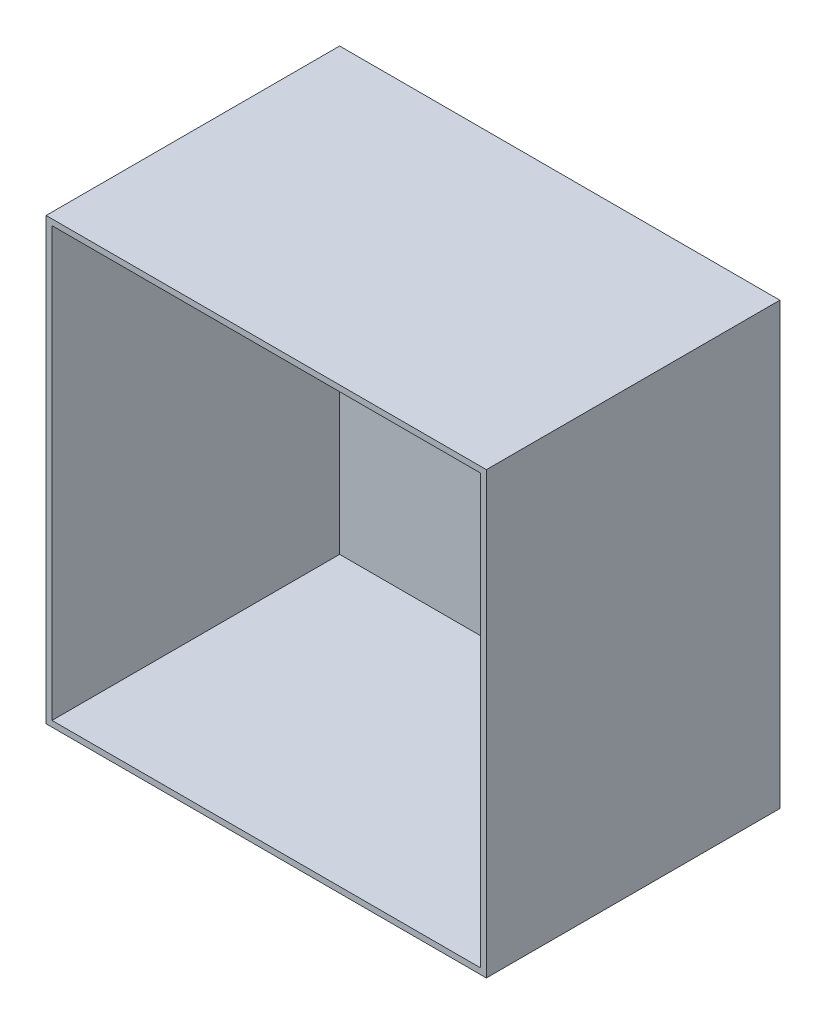
ISO-10303-21;
HEADER;
FILE_DESCRIPTION(('STEP AP214'),'2;1');
FILE_NAME('part.step','',(''),(''),'','','');
FILE_SCHEMA(('AUTOMOTIVE_DESIGN { 1 0 10303 214 1 1 1 1 }'));
ENDSEC;
DATA;
#1=APPLICATION_CONTEXT('core data for automotive mechanical design processes');
#2=APPLICATION_PROTOCOL_DEFINITION('international standard','automotive_design',2000,#1);
#3=PRODUCT_CONTEXT('',#1,'mechanical');
#4=PRODUCT('Part','Part','',(#3));
#5=PRODUCT_RELATED_PRODUCT_CATEGORY('part','',(#4));
#6=PRODUCT_DEFINITION_FORMATION('','',#4);
#7=PRODUCT_DEFINITION_CONTEXT('part definition',#1,'design');
#8=PRODUCT_DEFINITION('design','',#6,#7);
#9=PRODUCT_DEFINITION_SHAPE('','',#8);
#10=(LENGTH_UNIT() NAMED_UNIT(*) SI_UNIT(.MILLI.,.METRE.));
#11=(NAMED_UNIT(*) PLANE_ANGLE_UNIT() SI_UNIT($,.RADIAN.));
#12=(NAMED_UNIT(*) SI_UNIT($,.STERADIAN.) SOLID_ANGLE_UNIT());
#13=UNCERTAINTY_MEASURE_WITH_UNIT(LENGTH_MEASURE(1.E-05),#10,'distance_accuracy_value','');
#14=(GEOMETRIC_REPRESENTATION_CONTEXT(3) GLOBAL_UNCERTAINTY_ASSIGNED_CONTEXT((#13)) GLOBAL_UNIT_ASSIGNED_CONTEXT((#10,
#11,#12)) REPRESENTATION_CONTEXT('',''));
#15=CARTESIAN_POINT('',(0.,0.,0.));
#16=DIRECTION('',(0.,0.,1.));
#17=DIRECTION('',(1.,0.,0.));
#18=AXIS2_PLACEMENT_3D('',#15,#16,#17);
#19=CARTESIAN_POINT('',(-75.,-75.,100.));
#20=DIRECTION('',(1.,0.,0.));
#21=DIRECTION('',(0.,1.,0.));
#22=AXIS2_PLACEMENT_3D('',#19,#20,#21);
#23=PLANE('',#22);
#24=DIRECTION('',(0.,-1.,0.));
#25=VECTOR('',#24,1.);
#26=CARTESIAN_POINT('',(-75.,-75.,0.));
#27=LINE('',#26,#25);
#28=CARTESIAN_POINT('',(-75.,75.,0.));
#29=VERTEX_POINT('',#28);
#30=CARTESIAN_POINT('',(-75.,-75.,0.));
#31=VERTEX_POINT('',#30);
#32=EDGE_CURVE('E148',#29,#31,#27,.T.);
#33=ORIENTED_EDGE('',*,*,#32,.T.);
#34=DIRECTION('',(0.,0.,-1.));
#35=VECTOR('',#34,1.);
#36=CARTESIAN_POINT('',(-75.,-75.,100.));
#37=LINE('',#36,#35);
#38=CARTESIAN_POINT('',(-75.,-75.,100.));
#39=VERTEX_POINT('',#38);
#40=EDGE_CURVE('E11',#39,#31,#37,.T.);
#41=ORIENTED_EDGE('',*,*,#40,.F.);
#42=DIRECTION('',(0.,-1.,0.));
#43=VECTOR('',#42,1.);
#44=CARTESIAN_POINT('',(-75.,-75.,100.));
#45=LINE('',#44,#43);
#46=CARTESIAN_POINT('',(-75.,75.,100.));
#47=VERTEX_POINT('',#46);
#48=EDGE_CURVE('E141',#47,#39,#45,.T.);
#49=ORIENTED_EDGE('',*,*,#48,.F.);
#50=DIRECTION('',(0.,0.,-1.));
#51=VECTOR('',#50,1.);
#52=CARTESIAN_POINT('',(-75.,75.,100.));
#53=LINE('',#52,#51);
#54=EDGE_CURVE('E147',#47,#29,#53,.T.);
#55=ORIENTED_EDGE('',*,*,#54,.T.);
#56=EDGE_LOOP('',(#33,#41,#49,#55));
#57=FACE_BOUND('',#56,.T.);
#58=ADVANCED_FACE('F34',(#57),#23,.F.);
#59=CARTESIAN_POINT('',(75.,-75.,100.));
#60=DIRECTION('',(0.,1.,0.));
#61=DIRECTION('',(-1.,0.,0.));
#62=AXIS2_PLACEMENT_3D('',#59,#60,#61);
#63=PLANE('',#62);
#64=DIRECTION('',(1.,0.,0.));
#65=VECTOR('',#64,1.);
#66=CARTESIAN_POINT('',(75.,-75.,0.));
#67=LINE('',#66,#65);
#68=CARTESIAN_POINT('',(75.,-75.,0.));
#69=VERTEX_POINT('',#68);
#70=EDGE_CURVE('E151',#31,#69,#67,.T.);
#71=ORIENTED_EDGE('',*,*,#70,.T.);
#72=DIRECTION('',(0.,0.,-1.));
#73=VECTOR('',#72,1.);
#74=CARTESIAN_POINT('',(75.,-75.,100.));
#75=LINE('',#74,#73);
#76=CARTESIAN_POINT('',(75.,-75.,100.));
#77=VERTEX_POINT('',#76);
#78=EDGE_CURVE('E41',#77,#69,#75,.T.);
#79=ORIENTED_EDGE('',*,*,#78,.F.);
#80=DIRECTION('',(1.,0.,0.));
#81=VECTOR('',#80,1.);
#82=CARTESIAN_POINT('',(75.,-75.,100.));
#83=LINE('',#82,#81);
#84=EDGE_CURVE('E85',#39,#77,#83,.T.);
#85=ORIENTED_EDGE('',*,*,#84,.F.);
#86=ORIENTED_EDGE('',*,*,#40,.T.);
#87=EDGE_LOOP('',(#71,#79,#85,#86));
#88=FACE_BOUND('',#87,.T.);
#89=ADVANCED_FACE('F180',(#88),#63,.F.);
#90=CARTESIAN_POINT('',(75.,-75.,100.));
#91=DIRECTION('',(-1.,0.,0.));
#92=DIRECTION('',(0.,0.,1.));
#93=AXIS2_PLACEMENT_3D('',#90,#91,#92);
#94=PLANE('',#93);
#95=DIRECTION('',(0.,1.,0.));
#96=VECTOR('',#95,1.);
#97=CARTESIAN_POINT('',(75.,-75.,0.));
#98=LINE('',#97,#96);
#99=CARTESIAN_POINT('',(75.,75.,0.));
#100=VERTEX_POINT('',#99);
#101=EDGE_CURVE('E153',#69,#100,#98,.T.);
#102=ORIENTED_EDGE('',*,*,#101,.T.);
#103=DIRECTION('',(0.,0.,-1.));
#104=VECTOR('',#103,1.);
#105=CARTESIAN_POINT('',(75.,75.,100.));
#106=LINE('',#105,#104);
#107=CARTESIAN_POINT('',(75.,75.,100.));
#108=VERTEX_POINT('',#107);
#109=EDGE_CURVE('E157',#108,#100,#106,.T.);
#110=ORIENTED_EDGE('',*,*,#109,.F.);
#111=DIRECTION('',(0.,1.,0.));
#112=VECTOR('',#111,1.);
#113=CARTESIAN_POINT('',(75.,-75.,100.));
#114=LINE('',#113,#112);
#115=EDGE_CURVE('E144',#77,#108,#114,.T.);
#116=ORIENTED_EDGE('',*,*,#115,.F.);
#117=ORIENTED_EDGE('',*,*,#78,.T.);
#118=EDGE_LOOP('',(#102,#110,#116,#117));
#119=FACE_BOUND('',#118,.T.);
#120=ADVANCED_FACE('F162',(#119),#94,.F.);
#121=CARTESIAN_POINT('',(75.,75.,100.));
#122=DIRECTION('',(0.,-1.,0.));
#123=DIRECTION('',(1.,0.,0.));
#124=AXIS2_PLACEMENT_3D('',#121,#122,#123);
#125=PLANE('',#124);
#126=DIRECTION('',(-1.,0.,0.));
#127=VECTOR('',#126,1.);
#128=CARTESIAN_POINT('',(75.,75.,0.));
#129=LINE('',#128,#127);
#130=EDGE_CURVE('E78',#100,#29,#129,.T.);
#131=ORIENTED_EDGE('',*,*,#130,.T.);
#132=ORIENTED_EDGE('',*,*,#54,.F.);
#133=DIRECTION('',(-1.,0.,0.));
#134=VECTOR('',#133,1.);
#135=CARTESIAN_POINT('',(75.,75.,100.));
#136=LINE('',#135,#134);
#137=EDGE_CURVE('E57',#108,#47,#136,.T.);
#138=ORIENTED_EDGE('',*,*,#137,.F.);
#139=ORIENTED_EDGE('',*,*,#109,.T.);
#140=EDGE_LOOP('',(#131,#132,#138,#139));
#141=FACE_BOUND('',#140,.T.);
#142=ADVANCED_FACE('F170',(#141),#125,.F.);
#143=CARTESIAN_POINT('',(0.,0.,100.));
#144=DIRECTION('',(0.,0.,1.));
#145=DIRECTION('',(1.,0.,0.));
#146=AXIS2_PLACEMENT_3D('',#143,#144,#145);
#147=PLANE('',#146);
#148=DIRECTION('',(0.,-1.,0.));
#149=VECTOR('',#148,1.);
#150=CARTESIAN_POINT('',(-73.,-75.,100.));
#151=LINE('',#150,#149);
#152=CARTESIAN_POINT('',(-73.,73.,100.));
#153=VERTEX_POINT('',#152);
#154=CARTESIAN_POINT('',(-73.,-73.,100.));
#155=VERTEX_POINT('',#154);
#156=EDGE_CURVE('E130',#153,#155,#151,.T.);
#157=ORIENTED_EDGE('',*,*,#156,.F.);
#158=DIRECTION('',(-1.,0.,0.));
#159=VECTOR('',#158,1.);
#160=CARTESIAN_POINT('',(75.,73.,100.));
#161=LINE('',#160,#159);
#162=CARTESIAN_POINT('',(73.,73.,100.));
#163=VERTEX_POINT('',#162);
#164=EDGE_CURVE('E139',#163,#153,#161,.T.);
#165=ORIENTED_EDGE('',*,*,#164,.F.);
#166=DIRECTION('',(0.,1.,0.));
#167=VECTOR('',#166,1.);
#168=CARTESIAN_POINT('',(73.,-75.,100.));
#169=LINE('',#168,#167);
#170=CARTESIAN_POINT('',(73.,-73.,100.));
#171=VERTEX_POINT('',#170);
#172=EDGE_CURVE('E137',#171,#163,#169,.T.);
#173=ORIENTED_EDGE('',*,*,#172,.F.);
#174=DIRECTION('',(1.,0.,0.));
#175=VECTOR('',#174,1.);
#176=CARTESIAN_POINT('',(75.,-73.,100.));
#177=LINE('',#176,#175);
#178=EDGE_CURVE('E122',#155,#171,#177,.T.);
#179=ORIENTED_EDGE('',*,*,#178,.F.);
#180=EDGE_LOOP('',(#157,#165,#173,#179));
#181=FACE_BOUND('',#180,.T.);
#182=ORIENTED_EDGE('',*,*,#48,.T.);
#183=ORIENTED_EDGE('',*,*,#84,.T.);
#184=ORIENTED_EDGE('',*,*,#115,.T.);
#185=ORIENTED_EDGE('',*,*,#137,.T.);
#186=EDGE_LOOP('',(#182,#183,#184,#185));
#187=FACE_BOUND('',#186,.T.);
#188=ADVANCED_FACE('F172',(#181,#187),#147,.T.);
#189=CARTESIAN_POINT('',(0.,0.,0.));
#190=DIRECTION('',(0.,0.,1.));
#191=DIRECTION('',(1.,0.,0.));
#192=AXIS2_PLACEMENT_3D('',#189,#190,#191);
#193=PLANE('',#192);
#194=ORIENTED_EDGE('',*,*,#32,.F.);
#195=ORIENTED_EDGE('',*,*,#130,.F.);
#196=ORIENTED_EDGE('',*,*,#101,.F.);
#197=ORIENTED_EDGE('',*,*,#70,.F.);
#198=EDGE_LOOP('',(#194,#195,#196,#197));
#199=FACE_BOUND('',#198,.T.);
#200=ADVANCED_FACE('F166',(#199),#193,.F.);
#201=CARTESIAN_POINT('',(-73.,-75.,100.));
#202=DIRECTION('',(1.,0.,0.));
#203=DIRECTION('',(0.,1.,0.));
#204=AXIS2_PLACEMENT_3D('',#201,#202,#203);
#205=PLANE('',#204);
#206=DIRECTION('',(0.,-1.,0.));
#207=VECTOR('',#206,1.);
#208=CARTESIAN_POINT('',(-73.,-75.,2.));
#209=LINE('',#208,#207);
#210=CARTESIAN_POINT('',(-73.,73.,2.));
#211=VERTEX_POINT('',#210);
#212=CARTESIAN_POINT('',(-73.,-73.,2.));
#213=VERTEX_POINT('',#212);
#214=EDGE_CURVE('E113',#211,#213,#209,.T.);
#215=ORIENTED_EDGE('',*,*,#214,.F.);
#216=DIRECTION('',(0.,0.,-1.));
#217=VECTOR('',#216,1.);
#218=CARTESIAN_POINT('',(-73.,73.,100.));
#219=LINE('',#218,#217);
#220=EDGE_CURVE('E133',#153,#211,#219,.T.);
#221=ORIENTED_EDGE('',*,*,#220,.F.);
#222=ORIENTED_EDGE('',*,*,#156,.T.);
#223=DIRECTION('',(0.,0.,-1.));
#224=VECTOR('',#223,1.);
#225=CARTESIAN_POINT('',(-73.,-73.,100.));
#226=LINE('',#225,#224);
#227=EDGE_CURVE('E125',#155,#213,#226,.T.);
#228=ORIENTED_EDGE('',*,*,#227,.T.);
#229=EDGE_LOOP('',(#215,#221,#222,#228));
#230=FACE_BOUND('',#229,.T.);
#231=ADVANCED_FACE('F207',(#230),#205,.T.);
#232=CARTESIAN_POINT('',(75.,-73.,100.));
#233=DIRECTION('',(0.,1.,0.));
#234=DIRECTION('',(-1.,0.,0.));
#235=AXIS2_PLACEMENT_3D('',#232,#233,#234);
#236=PLANE('',#235);
#237=DIRECTION('',(1.,0.,0.));
#238=VECTOR('',#237,1.);
#239=CARTESIAN_POINT('',(75.,-73.,2.));
#240=LINE('',#239,#238);
#241=CARTESIAN_POINT('',(73.,-73.,2.));
#242=VERTEX_POINT('',#241);
#243=EDGE_CURVE('E107',#213,#242,#240,.T.);
#244=ORIENTED_EDGE('',*,*,#243,.F.);
#245=ORIENTED_EDGE('',*,*,#227,.F.);
#246=ORIENTED_EDGE('',*,*,#178,.T.);
#247=DIRECTION('',(0.,0.,-1.));
#248=VECTOR('',#247,1.);
#249=CARTESIAN_POINT('',(73.,-73.,100.));
#250=LINE('',#249,#248);
#251=EDGE_CURVE('E119',#171,#242,#250,.T.);
#252=ORIENTED_EDGE('',*,*,#251,.T.);
#253=EDGE_LOOP('',(#244,#245,#246,#252));
#254=FACE_BOUND('',#253,.T.);
#255=ADVANCED_FACE('F120',(#254),#236,.T.);
#256=CARTESIAN_POINT('',(73.,-75.,100.));
#257=DIRECTION('',(-1.,0.,0.));
#258=DIRECTION('',(0.,0.,1.));
#259=AXIS2_PLACEMENT_3D('',#256,#257,#258);
#260=PLANE('',#259);
#261=DIRECTION('',(0.,1.,0.));
#262=VECTOR('',#261,1.);
#263=CARTESIAN_POINT('',(73.,-75.,2.));
#264=LINE('',#263,#262);
#265=CARTESIAN_POINT('',(73.,73.,2.));
#266=VERTEX_POINT('',#265);
#267=EDGE_CURVE('E111',#242,#266,#264,.T.);
#268=ORIENTED_EDGE('',*,*,#267,.F.);
#269=ORIENTED_EDGE('',*,*,#251,.F.);
#270=ORIENTED_EDGE('',*,*,#172,.T.);
#271=DIRECTION('',(0.,0.,-1.));
#272=VECTOR('',#271,1.);
#273=CARTESIAN_POINT('',(73.,73.,100.));
#274=LINE('',#273,#272);
#275=EDGE_CURVE('E48',#163,#266,#274,.T.);
#276=ORIENTED_EDGE('',*,*,#275,.T.);
#277=EDGE_LOOP('',(#268,#269,#270,#276));
#278=FACE_BOUND('',#277,.T.);
#279=ADVANCED_FACE('F127',(#278),#260,.T.);
#280=CARTESIAN_POINT('',(75.,73.,100.));
#281=DIRECTION('',(0.,-1.,0.));
#282=DIRECTION('',(1.,0.,0.));
#283=AXIS2_PLACEMENT_3D('',#280,#281,#282);
#284=PLANE('',#283);
#285=DIRECTION('',(-1.,0.,0.));
#286=VECTOR('',#285,1.);
#287=CARTESIAN_POINT('',(75.,73.,2.));
#288=LINE('',#287,#286);
#289=EDGE_CURVE('E128',#266,#211,#288,.T.);
#290=ORIENTED_EDGE('',*,*,#289,.F.);
#291=ORIENTED_EDGE('',*,*,#275,.F.);
#292=ORIENTED_EDGE('',*,*,#164,.T.);
#293=ORIENTED_EDGE('',*,*,#220,.T.);
#294=EDGE_LOOP('',(#290,#291,#292,#293));
#295=FACE_BOUND('',#294,.T.);
#296=ADVANCED_FACE('F237',(#295),#284,.T.);
#297=CARTESIAN_POINT('',(0.,0.,2.));
#298=DIRECTION('',(0.,0.,1.));
#299=DIRECTION('',(1.,0.,0.));
#300=AXIS2_PLACEMENT_3D('',#297,#298,#299);
#301=PLANE('',#300);
#302=ORIENTED_EDGE('',*,*,#214,.T.);
#303=ORIENTED_EDGE('',*,*,#243,.T.);
#304=ORIENTED_EDGE('',*,*,#267,.T.);
#305=ORIENTED_EDGE('',*,*,#289,.T.);
#306=EDGE_LOOP('',(#302,#303,#304,#305));
#307=FACE_BOUND('',#306,.T.);
#308=ADVANCED_FACE('F109',(#307),#301,.T.);
#309=CLOSED_SHELL('',(#58,#89,#120,#142,#188,#200,#231,#255,#279,#296,#308));
#310=MANIFOLD_SOLID_BREP('B2',#309);
#311=ADVANCED_BREP_SHAPE_REPRESENTATION('',(#18,#310),#14);
#312=SHAPE_DEFINITION_REPRESENTATION(#9,#311);
ENDSEC;
END-ISO-10303-21;
